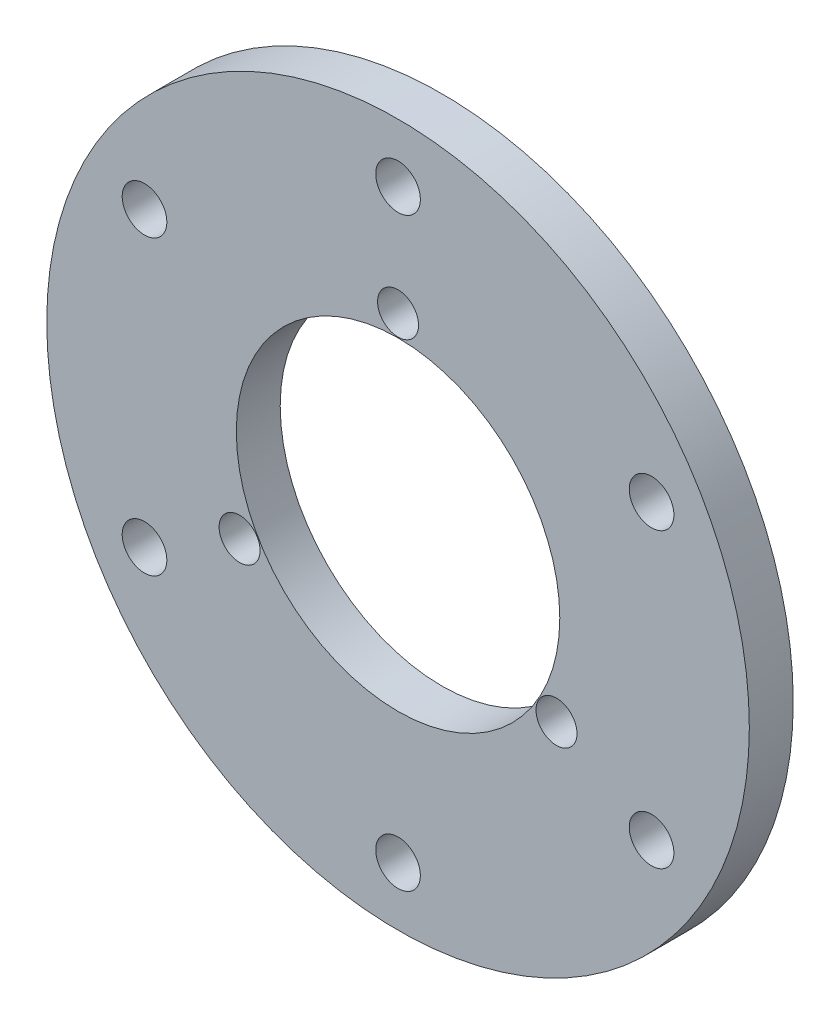
ISO-10303-21;
HEADER;
FILE_DESCRIPTION(('STEP AP214'),'2;1');
FILE_NAME('part.step','',(''),(''),'','','');
FILE_SCHEMA(('AUTOMOTIVE_DESIGN { 1 0 10303 214 1 1 1 1 }'));
ENDSEC;
DATA;
#1=APPLICATION_CONTEXT('core data for automotive mechanical design processes');
#2=APPLICATION_PROTOCOL_DEFINITION('international standard','automotive_design',2000,#1);
#3=PRODUCT_CONTEXT('',#1,'mechanical');
#4=PRODUCT('Part','Part','',(#3));
#5=PRODUCT_RELATED_PRODUCT_CATEGORY('part','',(#4));
#6=PRODUCT_DEFINITION_FORMATION('','',#4);
#7=PRODUCT_DEFINITION_CONTEXT('part definition',#1,'design');
#8=PRODUCT_DEFINITION('design','',#6,#7);
#9=PRODUCT_DEFINITION_SHAPE('','',#8);
#10=(LENGTH_UNIT() NAMED_UNIT(*) SI_UNIT(.MILLI.,.METRE.));
#11=(NAMED_UNIT(*) PLANE_ANGLE_UNIT() SI_UNIT($,.RADIAN.));
#12=(NAMED_UNIT(*) SI_UNIT($,.STERADIAN.) SOLID_ANGLE_UNIT());
#13=UNCERTAINTY_MEASURE_WITH_UNIT(LENGTH_MEASURE(1.E-05),#10,'distance_accuracy_value','');
#14=(GEOMETRIC_REPRESENTATION_CONTEXT(3) GLOBAL_UNCERTAINTY_ASSIGNED_CONTEXT((#13)) GLOBAL_UNIT_ASSIGNED_CONTEXT((#10,
#11,#12)) REPRESENTATION_CONTEXT('',''));
#15=CARTESIAN_POINT('',(0.,0.,0.));
#16=DIRECTION('',(0.,0.,1.));
#17=DIRECTION('',(1.,0.,0.));
#18=AXIS2_PLACEMENT_3D('',#15,#16,#17);
#19=CARTESIAN_POINT('',(0.,0.,3.));
#20=DIRECTION('',(0.,0.,1.));
#21=DIRECTION('',(1.,0.,0.));
#22=AXIS2_PLACEMENT_3D('',#19,#20,#21);
#23=PLANE('',#22);
#24=CARTESIAN_POINT('',(10.8253175473055,-6.25,3.));
#25=DIRECTION('',(0.,0.,1.));
#26=DIRECTION('',(1.,0.,0.));
#27=AXIS2_PLACEMENT_3D('',#24,#25,#26);
#28=CIRCLE('',#27,1.40000000000006);
#29=CARTESIAN_POINT('',(12.2253175473055,-6.25,3.));
#30=VERTEX_POINT('',#29);
#31=EDGE_CURVE('E99',#30,#30,#28,.T.);
#32=ORIENTED_EDGE('',*,*,#31,.F.);
#33=EDGE_LOOP('',(#32));
#34=FACE_BOUND('',#33,.T.);
#35=CARTESIAN_POINT('',(-17.3205080756888,-10.,3.));
#36=DIRECTION('',(0.,0.,1.));
#37=DIRECTION('',(1.,0.,0.));
#38=AXIS2_PLACEMENT_3D('',#35,#36,#37);
#39=CIRCLE('',#38,1.525);
#40=CARTESIAN_POINT('',(-15.7955080756888,-10.,3.));
#41=VERTEX_POINT('',#40);
#42=EDGE_CURVE('E103',#41,#41,#39,.T.);
#43=ORIENTED_EDGE('',*,*,#42,.F.);
#44=EDGE_LOOP('',(#43));
#45=FACE_BOUND('',#44,.T.);
#46=CARTESIAN_POINT('',(17.3205080756888,-10.,3.));
#47=DIRECTION('',(0.,0.,1.));
#48=DIRECTION('',(1.,0.,0.));
#49=AXIS2_PLACEMENT_3D('',#46,#47,#48);
#50=CIRCLE('',#49,1.525);
#51=CARTESIAN_POINT('',(18.8455080756888,-10.,3.));
#52=VERTEX_POINT('',#51);
#53=EDGE_CURVE('E107',#52,#52,#50,.T.);
#54=ORIENTED_EDGE('',*,*,#53,.F.);
#55=EDGE_LOOP('',(#54));
#56=FACE_BOUND('',#55,.T.);
#57=CARTESIAN_POINT('',(0.,12.5,3.));
#58=DIRECTION('',(0.,0.,1.));
#59=DIRECTION('',(1.,0.,0.));
#60=AXIS2_PLACEMENT_3D('',#57,#58,#59);
#61=CIRCLE('',#60,1.4);
#62=CARTESIAN_POINT('',(1.4,12.5,3.));
#63=VERTEX_POINT('',#62);
#64=EDGE_CURVE('E66',#63,#63,#61,.T.);
#65=ORIENTED_EDGE('',*,*,#64,.F.);
#66=EDGE_LOOP('',(#65));
#67=FACE_BOUND('',#66,.T.);
#68=CARTESIAN_POINT('',(0.,0.,3.));
#69=DIRECTION('',(0.,0.,1.));
#70=DIRECTION('',(1.,0.,0.));
#71=AXIS2_PLACEMENT_3D('',#68,#69,#70);
#72=CIRCLE('',#71,11.05);
#73=CARTESIAN_POINT('',(11.05,0.,3.));
#74=VERTEX_POINT('',#73);
#75=EDGE_CURVE('E44',#74,#74,#72,.T.);
#76=ORIENTED_EDGE('',*,*,#75,.F.);
#77=EDGE_LOOP('',(#76));
#78=FACE_BOUND('',#77,.T.);
#79=CARTESIAN_POINT('',(0.,0.,3.));
#80=DIRECTION('',(0.,0.,1.));
#81=DIRECTION('',(1.,0.,0.));
#82=AXIS2_PLACEMENT_3D('',#79,#80,#81);
#83=CIRCLE('',#82,24.);
#84=CARTESIAN_POINT('',(24.,0.,3.));
#85=VERTEX_POINT('',#84);
#86=EDGE_CURVE('E11',#85,#85,#83,.T.);
#87=ORIENTED_EDGE('',*,*,#86,.T.);
#88=EDGE_LOOP('',(#87));
#89=FACE_BOUND('',#88,.T.);
#90=CARTESIAN_POINT('',(0.,20.,3.));
#91=DIRECTION('',(0.,0.,1.));
#92=DIRECTION('',(1.,0.,0.));
#93=AXIS2_PLACEMENT_3D('',#90,#91,#92);
#94=CIRCLE('',#93,1.525);
#95=CARTESIAN_POINT('',(1.525,20.,3.));
#96=VERTEX_POINT('',#95);
#97=EDGE_CURVE('E57',#96,#96,#94,.T.);
#98=ORIENTED_EDGE('',*,*,#97,.F.);
#99=EDGE_LOOP('',(#98));
#100=FACE_BOUND('',#99,.T.);
#101=CARTESIAN_POINT('',(17.3205080756888,10.,3.));
#102=DIRECTION('',(0.,0.,1.));
#103=DIRECTION('',(1.,0.,0.));
#104=AXIS2_PLACEMENT_3D('',#101,#102,#103);
#105=CIRCLE('',#104,1.525);
#106=CARTESIAN_POINT('',(18.8455080756888,10.,3.));
#107=VERTEX_POINT('',#106);
#108=EDGE_CURVE('E117',#107,#107,#105,.T.);
#109=ORIENTED_EDGE('',*,*,#108,.F.);
#110=EDGE_LOOP('',(#109));
#111=FACE_BOUND('',#110,.T.);
#112=CARTESIAN_POINT('',(0.,-20.,3.));
#113=DIRECTION('',(0.,0.,1.));
#114=DIRECTION('',(1.,0.,0.));
#115=AXIS2_PLACEMENT_3D('',#112,#113,#114);
#116=CIRCLE('',#115,1.525);
#117=CARTESIAN_POINT('',(1.525,-20.,3.));
#118=VERTEX_POINT('',#117);
#119=EDGE_CURVE('E121',#118,#118,#116,.T.);
#120=ORIENTED_EDGE('',*,*,#119,.F.);
#121=EDGE_LOOP('',(#120));
#122=FACE_BOUND('',#121,.T.);
#123=CARTESIAN_POINT('',(-17.3205080756888,9.99999999999999,3.));
#124=DIRECTION('',(0.,0.,1.));
#125=DIRECTION('',(1.,0.,0.));
#126=AXIS2_PLACEMENT_3D('',#123,#124,#125);
#127=CIRCLE('',#126,1.525);
#128=CARTESIAN_POINT('',(-15.7955080756888,9.99999999999999,3.));
#129=VERTEX_POINT('',#128);
#130=EDGE_CURVE('E125',#129,#129,#127,.T.);
#131=ORIENTED_EDGE('',*,*,#130,.F.);
#132=EDGE_LOOP('',(#131));
#133=FACE_BOUND('',#132,.T.);
#134=CARTESIAN_POINT('',(-10.8253175473055,-6.25000000000001,3.));
#135=DIRECTION('',(0.,0.,1.));
#136=DIRECTION('',(1.,0.,0.));
#137=AXIS2_PLACEMENT_3D('',#134,#135,#136);
#138=CIRCLE('',#137,1.40000000000012);
#139=CARTESIAN_POINT('',(-9.42531754730536,-6.25000000000001,3.));
#140=VERTEX_POINT('',#139);
#141=EDGE_CURVE('E128',#140,#140,#138,.T.);
#142=ORIENTED_EDGE('',*,*,#141,.F.);
#143=EDGE_LOOP('',(#142));
#144=FACE_BOUND('',#143,.T.);
#145=ADVANCED_FACE('F33',(#34,#45,#56,#67,#78,#89,#100,#111,#122,#133,#144),#23,.T.);
#146=CARTESIAN_POINT('',(0.,0.,0.));
#147=DIRECTION('',(0.,0.,1.));
#148=DIRECTION('',(1.,0.,0.));
#149=AXIS2_PLACEMENT_3D('',#146,#147,#148);
#150=PLANE('',#149);
#151=CARTESIAN_POINT('',(0.,0.,0.));
#152=DIRECTION('',(0.,0.,1.));
#153=DIRECTION('',(1.,0.,0.));
#154=AXIS2_PLACEMENT_3D('',#151,#152,#153);
#155=CIRCLE('',#154,24.);
#156=CARTESIAN_POINT('',(24.,0.,0.));
#157=VERTEX_POINT('',#156);
#158=EDGE_CURVE('E37',#157,#157,#155,.T.);
#159=ORIENTED_EDGE('',*,*,#158,.F.);
#160=EDGE_LOOP('',(#159));
#161=FACE_BOUND('',#160,.T.);
#162=CARTESIAN_POINT('',(0.,0.,0.));
#163=DIRECTION('',(0.,0.,1.));
#164=DIRECTION('',(1.,0.,0.));
#165=AXIS2_PLACEMENT_3D('',#162,#163,#164);
#166=CIRCLE('',#165,11.05);
#167=CARTESIAN_POINT('',(11.05,0.,0.));
#168=VERTEX_POINT('',#167);
#169=EDGE_CURVE('E47',#168,#168,#166,.T.);
#170=ORIENTED_EDGE('',*,*,#169,.T.);
#171=EDGE_LOOP('',(#170));
#172=FACE_BOUND('',#171,.T.);
#173=CARTESIAN_POINT('',(0.,20.,0.));
#174=DIRECTION('',(0.,0.,1.));
#175=DIRECTION('',(1.,0.,0.));
#176=AXIS2_PLACEMENT_3D('',#173,#174,#175);
#177=CIRCLE('',#176,1.525);
#178=CARTESIAN_POINT('',(1.525,20.,0.));
#179=VERTEX_POINT('',#178);
#180=EDGE_CURVE('E62',#179,#179,#177,.T.);
#181=ORIENTED_EDGE('',*,*,#180,.T.);
#182=EDGE_LOOP('',(#181));
#183=FACE_BOUND('',#182,.T.);
#184=CARTESIAN_POINT('',(0.,12.5,0.));
#185=DIRECTION('',(0.,0.,1.));
#186=DIRECTION('',(1.,0.,0.));
#187=AXIS2_PLACEMENT_3D('',#184,#185,#186);
#188=CIRCLE('',#187,1.4);
#189=CARTESIAN_POINT('',(1.4,12.5,0.));
#190=VERTEX_POINT('',#189);
#191=EDGE_CURVE('E63',#190,#190,#188,.T.);
#192=ORIENTED_EDGE('',*,*,#191,.T.);
#193=EDGE_LOOP('',(#192));
#194=FACE_BOUND('',#193,.T.);
#195=CARTESIAN_POINT('',(17.3205080756888,10.,0.));
#196=DIRECTION('',(0.,0.,1.));
#197=DIRECTION('',(1.,0.,0.));
#198=AXIS2_PLACEMENT_3D('',#195,#196,#197);
#199=CIRCLE('',#198,1.525);
#200=CARTESIAN_POINT('',(18.8455080756888,10.,0.));
#201=VERTEX_POINT('',#200);
#202=EDGE_CURVE('E199',#201,#201,#199,.T.);
#203=ORIENTED_EDGE('',*,*,#202,.T.);
#204=EDGE_LOOP('',(#203));
#205=FACE_BOUND('',#204,.T.);
#206=CARTESIAN_POINT('',(17.3205080756888,-10.,0.));
#207=DIRECTION('',(0.,0.,1.));
#208=DIRECTION('',(1.,0.,0.));
#209=AXIS2_PLACEMENT_3D('',#206,#207,#208);
#210=CIRCLE('',#209,1.525);
#211=CARTESIAN_POINT('',(18.8455080756888,-10.,0.));
#212=VERTEX_POINT('',#211);
#213=EDGE_CURVE('E155',#212,#212,#210,.T.);
#214=ORIENTED_EDGE('',*,*,#213,.T.);
#215=EDGE_LOOP('',(#214));
#216=FACE_BOUND('',#215,.T.);
#217=CARTESIAN_POINT('',(0.,-20.,0.));
#218=DIRECTION('',(0.,0.,1.));
#219=DIRECTION('',(1.,0.,0.));
#220=AXIS2_PLACEMENT_3D('',#217,#218,#219);
#221=CIRCLE('',#220,1.525);
#222=CARTESIAN_POINT('',(1.525,-20.,0.));
#223=VERTEX_POINT('',#222);
#224=EDGE_CURVE('E149',#223,#223,#221,.T.);
#225=ORIENTED_EDGE('',*,*,#224,.T.);
#226=EDGE_LOOP('',(#225));
#227=FACE_BOUND('',#226,.T.);
#228=CARTESIAN_POINT('',(-17.3205080756888,-10.,0.));
#229=DIRECTION('',(0.,0.,1.));
#230=DIRECTION('',(1.,0.,0.));
#231=AXIS2_PLACEMENT_3D('',#228,#229,#230);
#232=CIRCLE('',#231,1.525);
#233=CARTESIAN_POINT('',(-15.7955080756888,-10.,0.));
#234=VERTEX_POINT('',#233);
#235=EDGE_CURVE('E150',#234,#234,#232,.T.);
#236=ORIENTED_EDGE('',*,*,#235,.T.);
#237=EDGE_LOOP('',(#236));
#238=FACE_BOUND('',#237,.T.);
#239=CARTESIAN_POINT('',(-17.3205080756888,9.99999999999999,0.));
#240=DIRECTION('',(0.,0.,1.));
#241=DIRECTION('',(1.,0.,0.));
#242=AXIS2_PLACEMENT_3D('',#239,#240,#241);
#243=CIRCLE('',#242,1.525);
#244=CARTESIAN_POINT('',(-15.7955080756888,9.99999999999999,0.));
#245=VERTEX_POINT('',#244);
#246=EDGE_CURVE('E139',#245,#245,#243,.T.);
#247=ORIENTED_EDGE('',*,*,#246,.T.);
#248=EDGE_LOOP('',(#247));
#249=FACE_BOUND('',#248,.T.);
#250=CARTESIAN_POINT('',(10.8253175473055,-6.25,0.));
#251=DIRECTION('',(0.,0.,1.));
#252=DIRECTION('',(1.,0.,0.));
#253=AXIS2_PLACEMENT_3D('',#250,#251,#252);
#254=CIRCLE('',#253,1.40000000000006);
#255=CARTESIAN_POINT('',(12.2253175473055,-6.25,0.));
#256=VERTEX_POINT('',#255);
#257=EDGE_CURVE('E130',#256,#256,#254,.T.);
#258=ORIENTED_EDGE('',*,*,#257,.T.);
#259=EDGE_LOOP('',(#258));
#260=FACE_BOUND('',#259,.T.);
#261=CARTESIAN_POINT('',(-10.8253175473055,-6.25000000000001,0.));
#262=DIRECTION('',(0.,0.,1.));
#263=DIRECTION('',(1.,0.,0.));
#264=AXIS2_PLACEMENT_3D('',#261,#262,#263);
#265=CIRCLE('',#264,1.40000000000012);
#266=CARTESIAN_POINT('',(-9.42531754730536,-6.25000000000001,0.));
#267=VERTEX_POINT('',#266);
#268=EDGE_CURVE('E131',#267,#267,#265,.T.);
#269=ORIENTED_EDGE('',*,*,#268,.T.);
#270=EDGE_LOOP('',(#269));
#271=FACE_BOUND('',#270,.T.);
#272=ADVANCED_FACE('F74',(#161,#172,#183,#194,#205,#216,#227,#238,#249,#260,#271),#150,.F.);
#273=CARTESIAN_POINT('',(0.,0.,3.));
#274=DIRECTION('',(0.,0.,-1.));
#275=DIRECTION('',(-1.,0.,0.));
#276=AXIS2_PLACEMENT_3D('',#273,#274,#275);
#277=CYLINDRICAL_SURFACE('',#276,24.);
#278=ORIENTED_EDGE('',*,*,#86,.F.);
#279=EDGE_LOOP('',(#278));
#280=FACE_BOUND('',#279,.T.);
#281=ORIENTED_EDGE('',*,*,#158,.T.);
#282=EDGE_LOOP('',(#281));
#283=FACE_BOUND('',#282,.T.);
#284=ADVANCED_FACE('F35',(#280,#283),#277,.T.);
#285=CARTESIAN_POINT('',(0.,0.,3.));
#286=DIRECTION('',(0.,0.,-1.));
#287=DIRECTION('',(-1.,0.,0.));
#288=AXIS2_PLACEMENT_3D('',#285,#286,#287);
#289=CYLINDRICAL_SURFACE('',#288,11.05);
#290=ORIENTED_EDGE('',*,*,#75,.T.);
#291=EDGE_LOOP('',(#290));
#292=FACE_BOUND('',#291,.T.);
#293=ORIENTED_EDGE('',*,*,#169,.F.);
#294=EDGE_LOOP('',(#293));
#295=FACE_BOUND('',#294,.T.);
#296=ADVANCED_FACE('F77',(#292,#295),#289,.F.);
#297=CARTESIAN_POINT('',(0.,20.,3.));
#298=DIRECTION('',(0.,0.,-1.));
#299=DIRECTION('',(-1.,0.,0.));
#300=AXIS2_PLACEMENT_3D('',#297,#298,#299);
#301=CYLINDRICAL_SURFACE('',#300,1.525);
#302=ORIENTED_EDGE('',*,*,#97,.T.);
#303=EDGE_LOOP('',(#302));
#304=FACE_BOUND('',#303,.T.);
#305=ORIENTED_EDGE('',*,*,#180,.F.);
#306=EDGE_LOOP('',(#305));
#307=FACE_BOUND('',#306,.T.);
#308=ADVANCED_FACE('F79',(#304,#307),#301,.F.);
#309=CARTESIAN_POINT('',(0.,12.5,3.));
#310=DIRECTION('',(0.,0.,-1.));
#311=DIRECTION('',(-1.,0.,0.));
#312=AXIS2_PLACEMENT_3D('',#309,#310,#311);
#313=CYLINDRICAL_SURFACE('',#312,1.4);
#314=ORIENTED_EDGE('',*,*,#64,.T.);
#315=EDGE_LOOP('',(#314));
#316=FACE_BOUND('',#315,.T.);
#317=ORIENTED_EDGE('',*,*,#191,.F.);
#318=EDGE_LOOP('',(#317));
#319=FACE_BOUND('',#318,.T.);
#320=ADVANCED_FACE('F85',(#316,#319),#313,.F.);
#321=CARTESIAN_POINT('',(17.3205080756888,10.,3.));
#322=DIRECTION('',(0.,0.,-1.));
#323=DIRECTION('',(-1.,0.,0.));
#324=AXIS2_PLACEMENT_3D('',#321,#322,#323);
#325=CYLINDRICAL_SURFACE('',#324,1.525);
#326=ORIENTED_EDGE('',*,*,#108,.T.);
#327=EDGE_LOOP('',(#326));
#328=FACE_BOUND('',#327,.T.);
#329=ORIENTED_EDGE('',*,*,#202,.F.);
#330=EDGE_LOOP('',(#329));
#331=FACE_BOUND('',#330,.T.);
#332=ADVANCED_FACE('F186',(#328,#331),#325,.F.);
#333=CARTESIAN_POINT('',(17.3205080756888,-10.,3.));
#334=DIRECTION('',(0.,0.,-1.));
#335=DIRECTION('',(-1.,0.,0.));
#336=AXIS2_PLACEMENT_3D('',#333,#334,#335);
#337=CYLINDRICAL_SURFACE('',#336,1.525);
#338=ORIENTED_EDGE('',*,*,#53,.T.);
#339=EDGE_LOOP('',(#338));
#340=FACE_BOUND('',#339,.T.);
#341=ORIENTED_EDGE('',*,*,#213,.F.);
#342=EDGE_LOOP('',(#341));
#343=FACE_BOUND('',#342,.T.);
#344=ADVANCED_FACE('F182',(#340,#343),#337,.F.);
#345=CARTESIAN_POINT('',(0.,-20.,3.));
#346=DIRECTION('',(0.,0.,-1.));
#347=DIRECTION('',(-1.,0.,0.));
#348=AXIS2_PLACEMENT_3D('',#345,#346,#347);
#349=CYLINDRICAL_SURFACE('',#348,1.525);
#350=ORIENTED_EDGE('',*,*,#119,.T.);
#351=EDGE_LOOP('',(#350));
#352=FACE_BOUND('',#351,.T.);
#353=ORIENTED_EDGE('',*,*,#224,.F.);
#354=EDGE_LOOP('',(#353));
#355=FACE_BOUND('',#354,.T.);
#356=ADVANCED_FACE('F175',(#352,#355),#349,.F.);
#357=CARTESIAN_POINT('',(-17.3205080756888,-10.,3.));
#358=DIRECTION('',(0.,0.,-1.));
#359=DIRECTION('',(-1.,0.,0.));
#360=AXIS2_PLACEMENT_3D('',#357,#358,#359);
#361=CYLINDRICAL_SURFACE('',#360,1.525);
#362=ORIENTED_EDGE('',*,*,#42,.T.);
#363=EDGE_LOOP('',(#362));
#364=FACE_BOUND('',#363,.T.);
#365=ORIENTED_EDGE('',*,*,#235,.F.);
#366=EDGE_LOOP('',(#365));
#367=FACE_BOUND('',#366,.T.);
#368=ADVANCED_FACE('F166',(#364,#367),#361,.F.);
#369=CARTESIAN_POINT('',(-17.3205080756888,9.99999999999999,3.));
#370=DIRECTION('',(0.,0.,-1.));
#371=DIRECTION('',(-1.,0.,0.));
#372=AXIS2_PLACEMENT_3D('',#369,#370,#371);
#373=CYLINDRICAL_SURFACE('',#372,1.525);
#374=ORIENTED_EDGE('',*,*,#130,.T.);
#375=EDGE_LOOP('',(#374));
#376=FACE_BOUND('',#375,.T.);
#377=ORIENTED_EDGE('',*,*,#246,.F.);
#378=EDGE_LOOP('',(#377));
#379=FACE_BOUND('',#378,.T.);
#380=ADVANCED_FACE('F163',(#376,#379),#373,.F.);
#381=CARTESIAN_POINT('',(10.8253175473055,-6.25,3.));
#382=DIRECTION('',(0.,0.,-1.));
#383=DIRECTION('',(-1.,0.,0.));
#384=AXIS2_PLACEMENT_3D('',#381,#382,#383);
#385=CYLINDRICAL_SURFACE('',#384,1.40000000000006);
#386=ORIENTED_EDGE('',*,*,#31,.T.);
#387=EDGE_LOOP('',(#386));
#388=FACE_BOUND('',#387,.T.);
#389=ORIENTED_EDGE('',*,*,#257,.F.);
#390=EDGE_LOOP('',(#389));
#391=FACE_BOUND('',#390,.T.);
#392=ADVANCED_FACE('F165',(#388,#391),#385,.F.);
#393=CARTESIAN_POINT('',(-10.8253175473055,-6.25000000000001,3.));
#394=DIRECTION('',(0.,0.,-1.));
#395=DIRECTION('',(-1.,0.,0.));
#396=AXIS2_PLACEMENT_3D('',#393,#394,#395);
#397=CYLINDRICAL_SURFACE('',#396,1.40000000000012);
#398=ORIENTED_EDGE('',*,*,#141,.T.);
#399=EDGE_LOOP('',(#398));
#400=FACE_BOUND('',#399,.T.);
#401=ORIENTED_EDGE('',*,*,#268,.F.);
#402=EDGE_LOOP('',(#401));
#403=FACE_BOUND('',#402,.T.);
#404=ADVANCED_FACE('F172',(#400,#403),#397,.F.);
#405=CLOSED_SHELL('',(#145,#272,#284,#296,#308,#320,#332,#344,#356,#368,#380,#392,#404));
#406=MANIFOLD_SOLID_BREP('B2',#405);
#407=ADVANCED_BREP_SHAPE_REPRESENTATION('',(#18,#406),#14);
#408=SHAPE_DEFINITION_REPRESENTATION(#9,#407);
ENDSEC;
END-ISO-10303-21;
